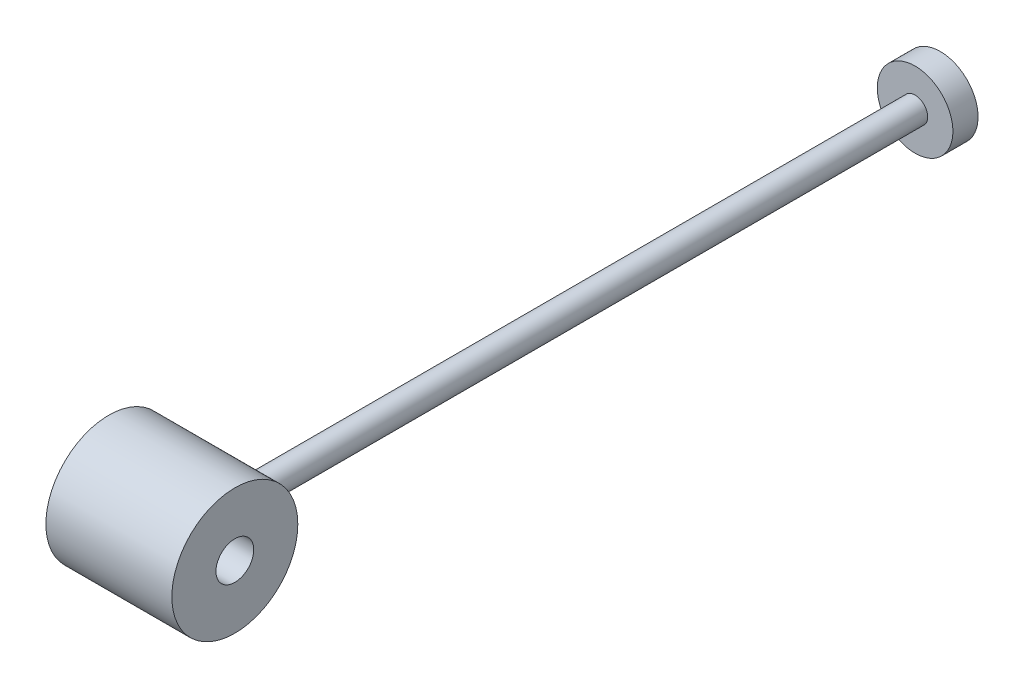
ISO-10303-21;
HEADER;
FILE_DESCRIPTION(('STEP AP214'),'2;1');
FILE_NAME('part.step','',(''),(''),'','','');
FILE_SCHEMA(('AUTOMOTIVE_DESIGN { 1 0 10303 214 1 1 1 1 }'));
ENDSEC;
DATA;
#1=APPLICATION_CONTEXT('core data for automotive mechanical design processes');
#2=APPLICATION_PROTOCOL_DEFINITION('international standard','automotive_design',2000,#1);
#3=PRODUCT_CONTEXT('',#1,'mechanical');
#4=PRODUCT('Part','Part','',(#3));
#5=PRODUCT_RELATED_PRODUCT_CATEGORY('part','',(#4));
#6=PRODUCT_DEFINITION_FORMATION('','',#4);
#7=PRODUCT_DEFINITION_CONTEXT('part definition',#1,'design');
#8=PRODUCT_DEFINITION('design','',#6,#7);
#9=PRODUCT_DEFINITION_SHAPE('','',#8);
#10=(LENGTH_UNIT() NAMED_UNIT(*) SI_UNIT(.MILLI.,.METRE.));
#11=(NAMED_UNIT(*) PLANE_ANGLE_UNIT() SI_UNIT($,.RADIAN.));
#12=(NAMED_UNIT(*) SI_UNIT($,.STERADIAN.) SOLID_ANGLE_UNIT());
#13=UNCERTAINTY_MEASURE_WITH_UNIT(LENGTH_MEASURE(1.E-05),#10,'distance_accuracy_value','');
#14=(GEOMETRIC_REPRESENTATION_CONTEXT(3) GLOBAL_UNCERTAINTY_ASSIGNED_CONTEXT((#13)) GLOBAL_UNIT_ASSIGNED_CONTEXT((#10,
#11,#12)) REPRESENTATION_CONTEXT('',''));
#15=CARTESIAN_POINT('',(0.,0.,0.));
#16=DIRECTION('',(0.,0.,1.));
#17=DIRECTION('',(1.,0.,0.));
#18=AXIS2_PLACEMENT_3D('',#15,#16,#17);
#19=CARTESIAN_POINT('',(0.,0.,-300.));
#20=DIRECTION('',(0.,0.,1.));
#21=DIRECTION('',(1.,0.,0.));
#22=AXIS2_PLACEMENT_3D('',#19,#20,#21);
#23=CYLINDRICAL_SURFACE('',#22,5.);
#24=CARTESIAN_POINT('',(5.,0.,-25.));
#25=CARTESIAN_POINT('',(5.00000276944634,0.138987493787324,-25.0000014065203));
#26=CARTESIAN_POINT('',(4.99420324928108,0.277940302046087,-24.9988389427216));
#27=CARTESIAN_POINT('',(4.97105635129736,0.554886864496204,-24.994224565157));
#28=CARTESIAN_POINT('',(4.95370679489748,0.692880432791918,-24.9907722194715));
#29=CARTESIAN_POINT('',(4.90758143771224,0.966937148503879,-24.981670242636));
#30=CARTESIAN_POINT('',(4.87879984551409,1.10299928122357,-24.9760194978176));
#31=CARTESIAN_POINT('',(4.81002534910899,1.37221108352448,-24.9626762565998));
#32=CARTESIAN_POINT('',(4.7700283237777,1.50535966309261,-24.9549830097359));
#33=CARTESIAN_POINT('',(4.67919625225816,1.76758319373794,-24.9377804442932));
#34=CARTESIAN_POINT('',(4.6283758297848,1.896663374225,-24.9282735779222));
#35=CARTESIAN_POINT('',(4.51622401781226,2.15009997814348,-24.9076944208426));
#36=CARTESIAN_POINT('',(4.45488875234116,2.2744546389337,-24.8966215531404));
#37=CARTESIAN_POINT('',(4.32219456929056,2.51749782000809,-24.8732206370355));
#38=CARTESIAN_POINT('',(4.25084014170608,2.63618884664851,-24.8608931515555));
#39=CARTESIAN_POINT('',(4.09856036475226,2.86722020463685,-24.8353088041128));
#40=CARTESIAN_POINT('',(4.01763144246466,2.97955814193968,-24.8220515959613));
#41=CARTESIAN_POINT('',(3.84577119317021,3.1983785388143,-24.7948114657324));
#42=CARTESIAN_POINT('',(3.75473335664577,3.30477652475172,-24.780821838943));
#43=CARTESIAN_POINT('',(3.56403766796452,3.50958996762925,-24.7526457290753));
#44=CARTESIAN_POINT('',(3.46437663408191,3.60800245195942,-24.738459174971));
#45=CARTESIAN_POINT('',(3.25716556407394,3.79610927604841,-24.7102933832022));
#46=CARTESIAN_POINT('',(3.1496178112366,3.88580612172819,-24.6963140869323));
#47=CARTESIAN_POINT('',(2.92729283454244,4.05592901668139,-24.6689453876667));
#48=CARTESIAN_POINT('',(2.81251295883554,4.13635163435981,-24.6555562041458));
#49=CARTESIAN_POINT('',(2.57548415685045,4.28798741229219,-24.6296394657581));
#50=CARTESIAN_POINT('',(2.4531786550123,4.35911381454494,-24.6171204770982));
#51=CARTESIAN_POINT('',(2.20287125287649,4.49081269831453,-24.5934353082732));
#52=CARTESIAN_POINT('',(2.07486723801243,4.55138122040544,-24.5822696361062));
#53=CARTESIAN_POINT('',(1.6837416438572,4.71644727257975,-24.5513304070068));
#54=CARTESIAN_POINT('',(1.41321932460559,4.80448882604819,-24.5340820165953));
#55=CARTESIAN_POINT('',(0.864538565206144,4.9326478026569,-24.508635793463));
#56=CARTESIAN_POINT('',(0.586526670293086,4.97337819482264,-24.5003223072134));
#57=CARTESIAN_POINT('',(0.027461501123977,5.00775493418216,-24.4933199482487));
#58=CARTESIAN_POINT('',(-0.253591459209596,5.00140609582257,-24.4946300913956));
#59=CARTESIAN_POINT('',(-0.806236719928547,4.94227436036826,-24.5066272442008));
#60=CARTESIAN_POINT('',(-1.07790777317425,4.89019310186595,-24.5171725589932));
#61=CARTESIAN_POINT('',(-1.60857963824175,4.7421890224497,-24.546227391949));
#62=CARTESIAN_POINT('',(-1.86757984431989,4.64626410780486,-24.5647372904544));
#63=CARTESIAN_POINT('',(-2.36757651014679,4.41262402680007,-24.6077809023025));
#64=CARTESIAN_POINT('',(-2.60843945190753,4.27463078523214,-24.632354484594));
#65=CARTESIAN_POINT('',(-3.06385419579619,3.96096784378848,-24.684730944745));
#66=CARTESIAN_POINT('',(-3.27840296964697,3.78529381392922,-24.7125341935642));
#67=CARTESIAN_POINT('',(-3.6791470271563,3.39749968079915,-24.7688510603976));
#68=CARTESIAN_POINT('',(-3.86476284328655,3.18478080820446,-24.797368460096));
#69=CARTESIAN_POINT('',(-4.19776922751518,2.73092511816778,-24.8514424361697));
#70=CARTESIAN_POINT('',(-4.34515930537601,2.48978793632426,-24.8769989745701));
#71=CARTESIAN_POINT('',(-4.59763754722347,1.98529693496818,-24.9223345079227));
#72=CARTESIAN_POINT('',(-4.70265946859707,1.72190909807364,-24.9421044423773));
#73=CARTESIAN_POINT('',(-4.86680236981849,1.18074488209619,-24.9735704494292));
#74=CARTESIAN_POINT('',(-4.92592890996419,0.902970250347196,-24.98526750005));
#75=CARTESIAN_POINT('',(-4.99578226936857,0.345897028150547,-24.9991335933204));
#76=CARTESIAN_POINT('',(-5.00730209891489,0.0667016415443211,-25.0014587325673));
#77=CARTESIAN_POINT('',(-4.98375070407561,-0.489624670880018,-24.9967525965614));
#78=CARTESIAN_POINT('',(-4.94868209878036,-0.766755711869968,-24.9897218472742));
#79=CARTESIAN_POINT('',(-4.8336081366968,-1.30852830007857,-24.9671916002008));
#80=CARTESIAN_POINT('',(-4.75400967390563,-1.57325974299468,-24.9517688194687));
#81=CARTESIAN_POINT('',(-4.55258007032458,-2.08561813620307,-24.9141776037933));
#82=CARTESIAN_POINT('',(-4.43074576544514,-2.33324380335236,-24.892008663478));
#83=CARTESIAN_POINT('',(-4.14658760866303,-2.80770587332562,-24.8429955738642));
#84=CARTESIAN_POINT('',(-3.98378632719944,-3.03425065213174,-24.8160975113418));
#85=CARTESIAN_POINT('',(-3.6229538115445,-3.45709007722326,-24.760736752006));
#86=CARTESIAN_POINT('',(-3.42491880020732,-3.65338147605436,-24.7322738876682));
#87=CARTESIAN_POINT('',(-2.9956341215523,-4.01320302351496,-24.6764651380018));
#88=CARTESIAN_POINT('',(-2.76392459020512,-4.17618877400404,-24.6491428619003));
#89=CARTESIAN_POINT('',(-2.2759398820373,-4.46092683850573,-24.5992097395686));
#90=CARTESIAN_POINT('',(-2.01966568861743,-4.58268080227279,-24.5765987048474));
#91=CARTESIAN_POINT('',(-1.49117106774616,-4.78076018011429,-24.5388364729789));
#92=CARTESIAN_POINT('',(-1.21904158214294,-4.85732111853824,-24.5236466726876));
#93=CARTESIAN_POINT('',(-0.665286950415525,-4.96353963899985,-24.5023739077135));
#94=CARTESIAN_POINT('',(-0.383663047477869,-4.99320333752649,-24.4962897554484));
#95=CARTESIAN_POINT('',(0.0366703889550776,-5.00179339144585,-24.4945288792509));
#96=CARTESIAN_POINT('',(0.175226568149243,-4.99885021968411,-24.4951330184965));
#97=CARTESIAN_POINT('',(0.451573795714482,-4.98148651470878,-24.4986714739674));
#98=CARTESIAN_POINT('',(0.589365114475224,-4.9670703371849,-24.5016049058833));
#99=CARTESIAN_POINT('',(0.863249015919121,-4.92686276339316,-24.5097212135577));
#100=CARTESIAN_POINT('',(0.99934098696874,-4.90106738632089,-24.5149048765081));
#101=CARTESIAN_POINT('',(1.26877990573972,-4.83831799577184,-24.5273664043086));
#102=CARTESIAN_POINT('',(1.40212781468395,-4.80136796328246,-24.5346435219816));
#103=CARTESIAN_POINT('',(1.66492270056654,-4.71667811844351,-24.5510651803018));
#104=CARTESIAN_POINT('',(1.79437724530106,-4.66896100938054,-24.5602057877658));
#105=CARTESIAN_POINT('',(2.0487516964052,-4.56306801677477,-24.5800998692381));
#106=CARTESIAN_POINT('',(2.17367318845506,-4.5048958336854,-24.5908527723703));
#107=CARTESIAN_POINT('',(2.41824756272708,-4.37847423732261,-24.6136768592635));
#108=CARTESIAN_POINT('',(2.53789823177196,-4.31022064232976,-24.6257485895239));
#109=CARTESIAN_POINT('',(2.77104924549456,-4.1641570153785,-24.6508678052533));
#110=CARTESIAN_POINT('',(2.88455168170255,-4.08635026305033,-24.6639149552593));
#111=CARTESIAN_POINT('',(3.10662673529869,-3.92025868558202,-24.6908640955351));
#112=CARTESIAN_POINT('',(3.21507953970716,-3.83181538764856,-24.7047769949563));
#113=CARTESIAN_POINT('',(3.42413829635704,-3.64620484015059,-24.7328525343466));
#114=CARTESIAN_POINT('',(3.52474699165411,-3.54904066604526,-24.7470150848702));
#115=CARTESIAN_POINT('',(3.71754062080305,-3.34655721556742,-24.7752095204235));
#116=CARTESIAN_POINT('',(3.80972053177606,-3.24123314471885,-24.7892413231228));
#117=CARTESIAN_POINT('',(3.98492694002668,-3.02322778921367,-24.8167717117019));
#118=CARTESIAN_POINT('',(4.06795679324696,-2.91054922625043,-24.8302704919035));
#119=CARTESIAN_POINT('',(4.22517389711511,-2.67729343786964,-24.8565085935593));
#120=CARTESIAN_POINT('',(4.29925523105979,-2.55664367436166,-24.869238066002));
#121=CARTESIAN_POINT('',(4.43694433521666,-2.30944481023433,-24.8934104051449));
#122=CARTESIAN_POINT('',(4.50055595131359,-2.18289789785572,-24.9048537437938));
#123=CARTESIAN_POINT('',(4.61682450350034,-1.9248233263731,-24.9261268452452));
#124=CARTESIAN_POINT('',(4.66948807030048,-1.79329873940674,-24.9359575839567));
#125=CARTESIAN_POINT('',(4.763487680713,-1.5261844247676,-24.9537310452209));
#126=CARTESIAN_POINT('',(4.8048259066209,-1.39059548585458,-24.9616741314688));
#127=CARTESIAN_POINT('',(4.89322312719739,-1.04920215690347,-24.9788087281562));
#128=CARTESIAN_POINT('',(4.93320981071553,-0.841457494405878,-24.9867141903289));
#129=CARTESIAN_POINT('',(4.98659571941881,-0.42244845328069,-24.9973086745575));
#130=CARTESIAN_POINT('',(4.99999579197194,-0.211184187046264,-24.9999978628663));
#131=CARTESIAN_POINT('',(5.,0.,-25.));
#132=B_SPLINE_CURVE_WITH_KNOTS('',3,(#24,#25,#26,#27,#28,#29,#30,#31,#32,#33,#34,#35,#36,#37,
#38,#39,#40,#41,#42,#43,#44,#45,#46,#47,#48,#49,#50,#51,#52,#53,#54,#55,#56,#57,#58,#59,#60,#61,
#62,#63,#64,#65,#66,#67,#68,#69,#70,#71,#72,#73,#74,#75,#76,#77,#78,#79,#80,#81,#82,#83,#84,#85,
#86,#87,#88,#89,#90,#91,#92,#93,#94,#95,#96,#97,#98,#99,#100,#101,#102,#103,#104,#105,#106,#107,
#108,#109,#110,#111,#112,#113,#114,#115,#116,#117,#118,#119,#120,#121,#122,#123,#124,#125,#126,
#127,#128,#129,#130,#131),.UNSPECIFIED.,.T.,.F.,(4,2,2,2,2,2,2,2,2,2,2,2,2,2,2,2,2,2,2,2,2,2,2,
2,2,2,2,2,2,2,2,2,2,2,2,2,2,2,2,2,2,2,2,2,2,2,2,2,2,2,2,2,2,4),(0.,0.416777047445417,
0.833632730149862,1.25069985977206,1.66792044248879,2.08458084615619,2.50139517036217,
2.91802329572164,3.33480738770838,3.75649664408719,4.17834216132243,4.60006602836891,
5.02194544187044,5.44751701120412,5.87324783701269,6.72369555497643,7.56299734191929,
8.40221330082507,9.22877443707772,10.0553750494503,10.8875625969434,11.7198458242473,
12.5671007113313,13.4143664637548,14.262951829465,15.1114343716656,15.9457248705771,
16.7799684696572,17.6067107843,18.4335150475649,19.2704413884317,20.1074575040603,
20.9572195157251,21.8069475229371,22.6522071384191,23.4973565033242,23.9127168808878,
24.3279196434016,24.7432677723233,25.1584678424529,25.5728004765726,25.9869867501795,
26.4013453111814,26.8155620171985,27.2369706991647,27.6582313488923,28.0797414220244,
28.5010963808509,28.9270309561325,29.3528087202144,29.7783278548953,30.203764937947,
30.8370559265658,31.4703267306209),.UNSPECIFIED.);
#133=CARTESIAN_POINT('',(5.,0.,-25.));
#134=VERTEX_POINT('',#133);
#135=EDGE_CURVE('E9',#134,#134,#132,.T.);
#136=ORIENTED_EDGE('',*,*,#135,.F.);
#137=EDGE_LOOP('',(#136));
#138=FACE_BOUND('',#137,.T.);
#139=CARTESIAN_POINT('',(0.,0.,-290.));
#140=DIRECTION('',(0.,0.,-1.));
#141=DIRECTION('',(-1.,0.,0.));
#142=AXIS2_PLACEMENT_3D('',#139,#140,#141);
#143=CIRCLE('',#142,5.);
#144=CARTESIAN_POINT('',(-5.,0.,-290.));
#145=VERTEX_POINT('',#144);
#146=EDGE_CURVE('E18',#145,#145,#143,.F.);
#147=ORIENTED_EDGE('',*,*,#146,.T.);
#148=EDGE_LOOP('',(#147));
#149=FACE_BOUND('',#148,.T.);
#150=ADVANCED_FACE('F14',(#138,#149),#23,.T.);
#151=CARTESIAN_POINT('',(-30.,0.,0.));
#152=DIRECTION('',(1.,0.,0.));
#153=DIRECTION('',(0.,0.,-1.));
#154=AXIS2_PLACEMENT_3D('',#151,#152,#153);
#155=CYLINDRICAL_SURFACE('',#154,25.);
#156=ORIENTED_EDGE('',*,*,#135,.T.);
#157=EDGE_LOOP('',(#156));
#158=FACE_BOUND('',#157,.T.);
#159=CARTESIAN_POINT('',(-30.,0.,0.));
#160=DIRECTION('',(1.,0.,0.));
#161=DIRECTION('',(0.,0.,-1.));
#162=AXIS2_PLACEMENT_3D('',#159,#160,#161);
#163=CIRCLE('',#162,25.);
#164=CARTESIAN_POINT('',(-30.,0.,-25.));
#165=VERTEX_POINT('',#164);
#166=EDGE_CURVE('E22',#165,#165,#163,.T.);
#167=ORIENTED_EDGE('',*,*,#166,.T.);
#168=EDGE_LOOP('',(#167));
#169=FACE_BOUND('',#168,.T.);
#170=CARTESIAN_POINT('',(20.,0.,0.));
#171=DIRECTION('',(1.,0.,0.));
#172=DIRECTION('',(0.,0.,-1.));
#173=AXIS2_PLACEMENT_3D('',#170,#171,#172);
#174=CIRCLE('',#173,25.);
#175=CARTESIAN_POINT('',(20.,0.,-25.));
#176=VERTEX_POINT('',#175);
#177=EDGE_CURVE('E26',#176,#176,#174,.T.);
#178=ORIENTED_EDGE('',*,*,#177,.F.);
#179=EDGE_LOOP('',(#178));
#180=FACE_BOUND('',#179,.T.);
#181=ADVANCED_FACE('F32',(#158,#169,#180),#155,.T.);
#182=CARTESIAN_POINT('',(-30.,0.,0.));
#183=DIRECTION('',(1.,0.,0.));
#184=DIRECTION('',(0.,0.,-1.));
#185=AXIS2_PLACEMENT_3D('',#182,#183,#184);
#186=PLANE('',#185);
#187=CARTESIAN_POINT('',(-30.,0.,0.));
#188=DIRECTION('',(1.,0.,0.));
#189=DIRECTION('',(0.,0.,-1.));
#190=AXIS2_PLACEMENT_3D('',#187,#188,#189);
#191=CIRCLE('',#190,7.5);
#192=CARTESIAN_POINT('',(-30.,0.,-7.5));
#193=VERTEX_POINT('',#192);
#194=EDGE_CURVE('E62',#193,#193,#191,.T.);
#195=ORIENTED_EDGE('',*,*,#194,.T.);
#196=EDGE_LOOP('',(#195));
#197=FACE_BOUND('',#196,.T.);
#198=ORIENTED_EDGE('',*,*,#166,.F.);
#199=EDGE_LOOP('',(#198));
#200=FACE_BOUND('',#199,.T.);
#201=ADVANCED_FACE('F36',(#197,#200),#186,.F.);
#202=CARTESIAN_POINT('',(20.,0.,0.));
#203=DIRECTION('',(1.,0.,0.));
#204=DIRECTION('',(0.,0.,-1.));
#205=AXIS2_PLACEMENT_3D('',#202,#203,#204);
#206=PLANE('',#205);
#207=CARTESIAN_POINT('',(20.,0.,0.));
#208=DIRECTION('',(1.,0.,0.));
#209=DIRECTION('',(0.,0.,-1.));
#210=AXIS2_PLACEMENT_3D('',#207,#208,#209);
#211=CIRCLE('',#210,7.5);
#212=CARTESIAN_POINT('',(20.,0.,-7.5));
#213=VERTEX_POINT('',#212);
#214=EDGE_CURVE('E59',#213,#213,#211,.T.);
#215=ORIENTED_EDGE('',*,*,#214,.F.);
#216=EDGE_LOOP('',(#215));
#217=FACE_BOUND('',#216,.T.);
#218=ORIENTED_EDGE('',*,*,#177,.T.);
#219=EDGE_LOOP('',(#218));
#220=FACE_BOUND('',#219,.T.);
#221=ADVANCED_FACE('F75',(#217,#220),#206,.T.);
#222=CARTESIAN_POINT('',(-30.,0.,0.));
#223=DIRECTION('',(1.,0.,0.));
#224=DIRECTION('',(0.,0.,-1.));
#225=AXIS2_PLACEMENT_3D('',#222,#223,#224);
#226=CYLINDRICAL_SURFACE('',#225,7.5);
#227=ORIENTED_EDGE('',*,*,#194,.F.);
#228=EDGE_LOOP('',(#227));
#229=FACE_BOUND('',#228,.T.);
#230=ORIENTED_EDGE('',*,*,#214,.T.);
#231=EDGE_LOOP('',(#230));
#232=FACE_BOUND('',#231,.T.);
#233=ADVANCED_FACE('F78',(#229,#232),#226,.F.);
#234=CARTESIAN_POINT('',(0.,0.,-290.));
#235=DIRECTION('',(0.,0.,-1.));
#236=DIRECTION('',(-1.,0.,0.));
#237=AXIS2_PLACEMENT_3D('',#234,#235,#236);
#238=CYLINDRICAL_SURFACE('',#237,15.);
#239=CARTESIAN_POINT('',(0.,0.,-290.));
#240=DIRECTION('',(0.,0.,-1.));
#241=DIRECTION('',(-1.,0.,0.));
#242=AXIS2_PLACEMENT_3D('',#239,#240,#241);
#243=CIRCLE('',#242,15.);
#244=CARTESIAN_POINT('',(-15.,0.,-290.));
#245=VERTEX_POINT('',#244);
#246=EDGE_CURVE('E60',#245,#245,#243,.T.);
#247=ORIENTED_EDGE('',*,*,#246,.T.);
#248=EDGE_LOOP('',(#247));
#249=FACE_BOUND('',#248,.T.);
#250=CARTESIAN_POINT('',(0.,0.,-300.));
#251=DIRECTION('',(0.,0.,-1.));
#252=DIRECTION('',(-1.,0.,0.));
#253=AXIS2_PLACEMENT_3D('',#250,#251,#252);
#254=CIRCLE('',#253,15.);
#255=CARTESIAN_POINT('',(-15.,0.,-300.));
#256=VERTEX_POINT('',#255);
#257=EDGE_CURVE('E65',#256,#256,#254,.T.);
#258=ORIENTED_EDGE('',*,*,#257,.F.);
#259=EDGE_LOOP('',(#258));
#260=FACE_BOUND('',#259,.T.);
#261=ADVANCED_FACE('F47',(#249,#260),#238,.T.);
#262=CARTESIAN_POINT('',(0.,0.,-290.));
#263=DIRECTION('',(0.,0.,-1.));
#264=DIRECTION('',(-1.,0.,0.));
#265=AXIS2_PLACEMENT_3D('',#262,#263,#264);
#266=PLANE('',#265);
#267=ORIENTED_EDGE('',*,*,#146,.F.);
#268=EDGE_LOOP('',(#267));
#269=FACE_BOUND('',#268,.T.);
#270=ORIENTED_EDGE('',*,*,#246,.F.);
#271=EDGE_LOOP('',(#270));
#272=FACE_BOUND('',#271,.T.);
#273=ADVANCED_FACE('F40',(#269,#272),#266,.F.);
#274=CARTESIAN_POINT('',(0.,0.,-300.));
#275=DIRECTION('',(0.,0.,1.));
#276=DIRECTION('',(1.,0.,0.));
#277=AXIS2_PLACEMENT_3D('',#274,#275,#276);
#278=PLANE('',#277);
#279=ORIENTED_EDGE('',*,*,#257,.T.);
#280=EDGE_LOOP('',(#279));
#281=FACE_BOUND('',#280,.T.);
#282=ADVANCED_FACE('F38',(#281),#278,.F.);
#283=CLOSED_SHELL('',(#150,#181,#201,#221,#233,#261,#273,#282));
#284=MANIFOLD_SOLID_BREP('B1',#283);
#285=ADVANCED_BREP_SHAPE_REPRESENTATION('',(#18,#284),#14);
#286=SHAPE_DEFINITION_REPRESENTATION(#9,#285);
ENDSEC;
END-ISO-10303-21;
